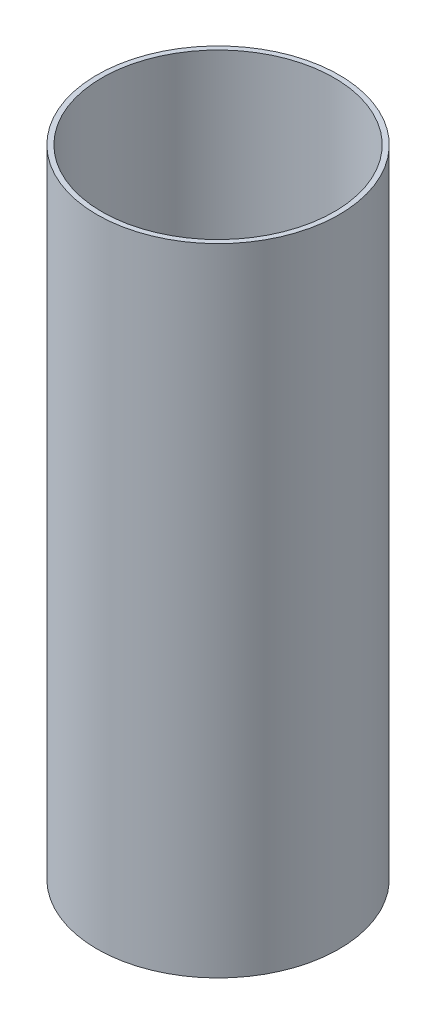
ISO-10303-21;
HEADER;
FILE_DESCRIPTION(('STEP AP214'),'2;1');
FILE_NAME('part.step','',(''),(''),'','','');
FILE_SCHEMA(('AUTOMOTIVE_DESIGN { 1 0 10303 214 1 1 1 1 }'));
ENDSEC;
DATA;
#1=APPLICATION_CONTEXT('core data for automotive mechanical design processes');
#2=APPLICATION_PROTOCOL_DEFINITION('international standard','automotive_design',2000,#1);
#3=PRODUCT_CONTEXT('',#1,'mechanical');
#4=PRODUCT('Part','Part','',(#3));
#5=PRODUCT_RELATED_PRODUCT_CATEGORY('part','',(#4));
#6=PRODUCT_DEFINITION_FORMATION('','',#4);
#7=PRODUCT_DEFINITION_CONTEXT('part definition',#1,'design');
#8=PRODUCT_DEFINITION('design','',#6,#7);
#9=PRODUCT_DEFINITION_SHAPE('','',#8);
#10=(LENGTH_UNIT() NAMED_UNIT(*) SI_UNIT(.MILLI.,.METRE.));
#11=(NAMED_UNIT(*) PLANE_ANGLE_UNIT() SI_UNIT($,.RADIAN.));
#12=(NAMED_UNIT(*) SI_UNIT($,.STERADIAN.) SOLID_ANGLE_UNIT());
#13=UNCERTAINTY_MEASURE_WITH_UNIT(LENGTH_MEASURE(1.E-05),#10,'distance_accuracy_value','');
#14=(GEOMETRIC_REPRESENTATION_CONTEXT(3) GLOBAL_UNCERTAINTY_ASSIGNED_CONTEXT((#13)) GLOBAL_UNIT_ASSIGNED_CONTEXT((#10,
#11,#12)) REPRESENTATION_CONTEXT('',''));
#15=CARTESIAN_POINT('',(0.,0.,0.));
#16=DIRECTION('',(0.,0.,1.));
#17=DIRECTION('',(1.,0.,0.));
#18=AXIS2_PLACEMENT_3D('',#15,#16,#17);
#19=CARTESIAN_POINT('',(0.,200.,0.));
#20=DIRECTION('',(0.,1.,0.));
#21=DIRECTION('',(0.,0.,1.));
#22=AXIS2_PLACEMENT_3D('',#19,#20,#21);
#23=PLANE('',#22);
#24=CARTESIAN_POINT('',(0.,200.,0.));
#25=DIRECTION('',(0.,1.,0.));
#26=DIRECTION('',(0.,0.,1.));
#27=AXIS2_PLACEMENT_3D('',#24,#25,#26);
#28=CIRCLE('',#27,38.0746);
#29=CARTESIAN_POINT('',(0.,200.,38.0746));
#30=VERTEX_POINT('',#29);
#31=EDGE_CURVE('E10',#30,#30,#28,.T.);
#32=ORIENTED_EDGE('',*,*,#31,.T.);
#33=EDGE_LOOP('',(#32));
#34=FACE_BOUND('',#33,.T.);
#35=CARTESIAN_POINT('',(0.,200.,0.));
#36=DIRECTION('',(0.,1.,0.));
#37=DIRECTION('',(0.,0.,1.));
#38=AXIS2_PLACEMENT_3D('',#35,#36,#37);
#39=CIRCLE('',#38,36.5125);
#40=CARTESIAN_POINT('',(0.,200.,36.5125));
#41=VERTEX_POINT('',#40);
#42=EDGE_CURVE('E56',#41,#41,#39,.T.);
#43=ORIENTED_EDGE('',*,*,#42,.F.);
#44=EDGE_LOOP('',(#43));
#45=FACE_BOUND('',#44,.T.);
#46=ADVANCED_FACE('F43',(#34,#45),#23,.T.);
#47=CARTESIAN_POINT('',(0.,0.,0.));
#48=DIRECTION('',(0.,1.,0.));
#49=DIRECTION('',(0.,0.,1.));
#50=AXIS2_PLACEMENT_3D('',#47,#48,#49);
#51=PLANE('',#50);
#52=CARTESIAN_POINT('',(0.,0.,0.));
#53=DIRECTION('',(0.,1.,0.));
#54=DIRECTION('',(0.,0.,1.));
#55=AXIS2_PLACEMENT_3D('',#52,#53,#54);
#56=CIRCLE('',#55,38.0746);
#57=CARTESIAN_POINT('',(0.,0.,38.0746));
#58=VERTEX_POINT('',#57);
#59=EDGE_CURVE('E47',#58,#58,#56,.T.);
#60=ORIENTED_EDGE('',*,*,#59,.F.);
#61=EDGE_LOOP('',(#60));
#62=FACE_BOUND('',#61,.T.);
#63=CARTESIAN_POINT('',(0.,0.,0.));
#64=DIRECTION('',(0.,1.,0.));
#65=DIRECTION('',(0.,0.,1.));
#66=AXIS2_PLACEMENT_3D('',#63,#64,#65);
#67=CIRCLE('',#66,36.5125);
#68=CARTESIAN_POINT('',(0.,0.,36.5125));
#69=VERTEX_POINT('',#68);
#70=EDGE_CURVE('E58',#69,#69,#67,.T.);
#71=ORIENTED_EDGE('',*,*,#70,.T.);
#72=EDGE_LOOP('',(#71));
#73=FACE_BOUND('',#72,.T.);
#74=ADVANCED_FACE('F70',(#62,#73),#51,.F.);
#75=CARTESIAN_POINT('',(0.,200.,0.));
#76=DIRECTION('',(0.,-1.,0.));
#77=DIRECTION('',(0.,0.,-1.));
#78=AXIS2_PLACEMENT_3D('',#75,#76,#77);
#79=CYLINDRICAL_SURFACE('',#78,38.0746);
#80=ORIENTED_EDGE('',*,*,#31,.F.);
#81=EDGE_LOOP('',(#80));
#82=FACE_BOUND('',#81,.T.);
#83=ORIENTED_EDGE('',*,*,#59,.T.);
#84=EDGE_LOOP('',(#83));
#85=FACE_BOUND('',#84,.T.);
#86=ADVANCED_FACE('F45',(#82,#85),#79,.T.);
#87=CARTESIAN_POINT('',(0.,200.,0.));
#88=DIRECTION('',(0.,-1.,0.));
#89=DIRECTION('',(0.,0.,-1.));
#90=AXIS2_PLACEMENT_3D('',#87,#88,#89);
#91=CYLINDRICAL_SURFACE('',#90,36.5125);
#92=ORIENTED_EDGE('',*,*,#42,.T.);
#93=EDGE_LOOP('',(#92));
#94=FACE_BOUND('',#93,.T.);
#95=ORIENTED_EDGE('',*,*,#70,.F.);
#96=EDGE_LOOP('',(#95));
#97=FACE_BOUND('',#96,.T.);
#98=ADVANCED_FACE('F66',(#94,#97),#91,.F.);
#99=CLOSED_SHELL('',(#46,#74,#86,#98));
#100=MANIFOLD_SOLID_BREP('B2',#99);
#101=ADVANCED_BREP_SHAPE_REPRESENTATION('',(#18,#100),#14);
#102=SHAPE_DEFINITION_REPRESENTATION(#9,#101);
ENDSEC;
END-ISO-10303-21;
